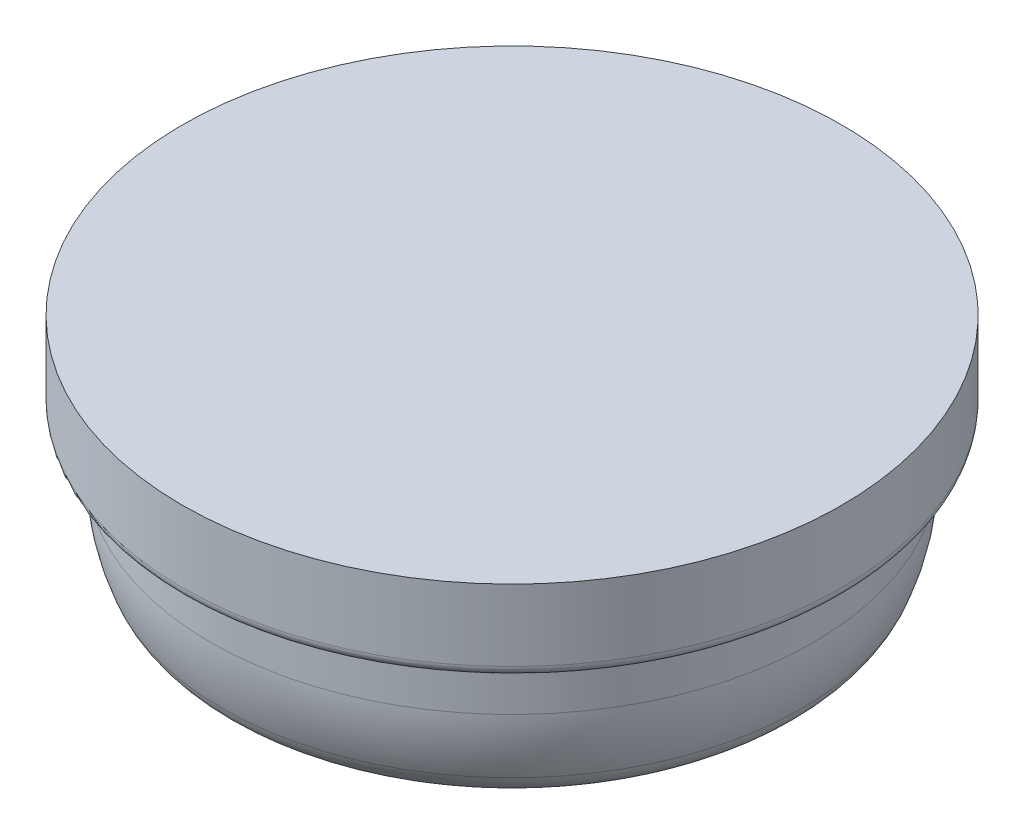
ISO-10303-21;
HEADER;
FILE_DESCRIPTION(('STEP AP214'),'2;1');
FILE_NAME('part.step','',(''),(''),'','','');
FILE_SCHEMA(('AUTOMOTIVE_DESIGN { 1 0 10303 214 1 1 1 1 }'));
ENDSEC;
DATA;
#1=APPLICATION_CONTEXT('core data for automotive mechanical design processes');
#2=APPLICATION_PROTOCOL_DEFINITION('international standard','automotive_design',2000,#1);
#3=PRODUCT_CONTEXT('',#1,'mechanical');
#4=PRODUCT('Part','Part','',(#3));
#5=PRODUCT_RELATED_PRODUCT_CATEGORY('part','',(#4));
#6=PRODUCT_DEFINITION_FORMATION('','',#4);
#7=PRODUCT_DEFINITION_CONTEXT('part definition',#1,'design');
#8=PRODUCT_DEFINITION('design','',#6,#7);
#9=PRODUCT_DEFINITION_SHAPE('','',#8);
#10=(LENGTH_UNIT() NAMED_UNIT(*) SI_UNIT(.MILLI.,.METRE.));
#11=(NAMED_UNIT(*) PLANE_ANGLE_UNIT() SI_UNIT($,.RADIAN.));
#12=(NAMED_UNIT(*) SI_UNIT($,.STERADIAN.) SOLID_ANGLE_UNIT());
#13=UNCERTAINTY_MEASURE_WITH_UNIT(LENGTH_MEASURE(1.E-05),#10,'distance_accuracy_value','');
#14=(GEOMETRIC_REPRESENTATION_CONTEXT(3) GLOBAL_UNCERTAINTY_ASSIGNED_CONTEXT((#13)) GLOBAL_UNIT_ASSIGNED_CONTEXT((#10,
#11,#12)) REPRESENTATION_CONTEXT('',''));
#15=CARTESIAN_POINT('',(0.,0.,0.));
#16=DIRECTION('',(0.,0.,1.));
#17=DIRECTION('',(1.,0.,0.));
#18=AXIS2_PLACEMENT_3D('',#15,#16,#17);
#19=CARTESIAN_POINT('',(0.,13.0472913738795,91.1860000000004));
#20=CARTESIAN_POINT('',(0.,13.0472913738794,93.9930756489206));
#21=CARTESIAN_POINT('',(0.,13.6614165071201,96.7096580848795));
#22=CARTESIAN_POINT('',(0.,14.832128030832,99.2127252525066));
#23=(BOUNDED_CURVE() B_SPLINE_CURVE(3,(#19,#20,#21,#22),.UNSPECIFIED.,.F.,
.F.) B_SPLINE_CURVE_WITH_KNOTS((4,4),(0.,1.),
.UNSPECIFIED.) CURVE() GEOMETRIC_REPRESENTATION_ITEM() RATIONAL_B_SPLINE_CURVE((0.254333095030252,
0.254333095030252,0.258499793724843,0.266833191114025)) REPRESENTATION_ITEM(''));
#24=CARTESIAN_POINT('',(0.,55.,0.));
#25=DIRECTION('',(0.,1.,0.));
#26=AXIS1_PLACEMENT('',#24,#25);
#27=SURFACE_OF_REVOLUTION('',#23,#26);
#28=CARTESIAN_POINT('',(0.,14.832128030832,0.));
#29=DIRECTION('',(0.,1.,0.));
#30=DIRECTION('',(0.,0.,1.));
#31=AXIS2_PLACEMENT_3D('',#28,#29,#30);
#32=CIRCLE('',#31,99.2127252525066);
#33=CARTESIAN_POINT('',(0.,14.832128030832,99.2127252525066));
#34=VERTEX_POINT('',#33);
#35=EDGE_CURVE('E66',#34,#34,#32,.T.);
#36=ORIENTED_EDGE('',*,*,#35,.F.);
#37=EDGE_LOOP('',(#36));
#38=FACE_BOUND('',#37,.T.);
#39=CARTESIAN_POINT('',(0.,13.0472913738796,0.));
#40=DIRECTION('',(0.,1.,0.));
#41=DIRECTION('',(0.,0.,1.));
#42=AXIS2_PLACEMENT_3D('',#39,#40,#41);
#43=CIRCLE('',#42,91.1860000000005);
#44=CARTESIAN_POINT('',(0.,13.0472913738796,91.1860000000005));
#45=VERTEX_POINT('',#44);
#46=EDGE_CURVE('E10',#45,#45,#43,.T.);
#47=ORIENTED_EDGE('',*,*,#46,.T.);
#48=EDGE_LOOP('',(#47));
#49=FACE_BOUND('',#48,.T.);
#50=ADVANCED_FACE('F34',(#38,#49),#27,.T.);
#51=CARTESIAN_POINT('',(0.,13.0472913738795,0.));
#52=DIRECTION('',(0.,-1.,0.));
#53=DIRECTION('',(0.,0.,-1.));
#54=AXIS2_PLACEMENT_3D('',#51,#52,#53);
#55=PLANE('',#54);
#56=ORIENTED_EDGE('',*,*,#46,.F.);
#57=EDGE_LOOP('',(#56));
#58=FACE_BOUND('',#57,.T.);
#59=ADVANCED_FACE('F79',(#58),#55,.T.);
#60=CARTESIAN_POINT('',(0.,113.365316058993,0.));
#61=DIRECTION('',(0.,-1.,0.));
#62=DIRECTION('',(0.,0.,-1.));
#63=AXIS2_PLACEMENT_3D('',#60,#61,#62);
#64=PLANE('',#63);
#65=CARTESIAN_POINT('',(0.,113.365316058993,0.));
#66=DIRECTION('',(0.,1.,0.));
#67=DIRECTION('',(0.,0.,1.));
#68=AXIS2_PLACEMENT_3D('',#65,#66,#67);
#69=CIRCLE('',#68,138.555289406168);
#70=CARTESIAN_POINT('',(0.,113.365316058993,138.555289406168));
#71=VERTEX_POINT('',#70);
#72=EDGE_CURVE('E41',#71,#71,#69,.T.);
#73=ORIENTED_EDGE('',*,*,#72,.T.);
#74=EDGE_LOOP('',(#73));
#75=FACE_BOUND('',#74,.T.);
#76=ADVANCED_FACE('F83',(#75),#64,.F.);
#77=CARTESIAN_POINT('',(0.,55.,0.));
#78=DIRECTION('',(0.,1.,0.));
#79=DIRECTION('',(0.,0.,1.));
#80=AXIS2_PLACEMENT_3D('',#77,#78,#79);
#81=CYLINDRICAL_SURFACE('',#80,138.555289406168);
#82=ORIENTED_EDGE('',*,*,#72,.F.);
#83=EDGE_LOOP('',(#82));
#84=FACE_BOUND('',#83,.T.);
#85=CARTESIAN_POINT('',(0.,83.3653160589928,0.));
#86=DIRECTION('',(0.,1.,0.));
#87=DIRECTION('',(0.,0.,1.));
#88=AXIS2_PLACEMENT_3D('',#85,#86,#87);
#89=CIRCLE('',#88,138.555289406168);
#90=CARTESIAN_POINT('',(0.,83.3653160589928,138.555289406168));
#91=VERTEX_POINT('',#90);
#92=EDGE_CURVE('E45',#91,#91,#89,.T.);
#93=ORIENTED_EDGE('',*,*,#92,.T.);
#94=EDGE_LOOP('',(#93));
#95=FACE_BOUND('',#94,.T.);
#96=ADVANCED_FACE('F88',(#84,#95),#81,.T.);
#97=CARTESIAN_POINT('',(0.,83.2420105318187,0.));
#98=DIRECTION('',(0.,1.,0.));
#99=DIRECTION('',(0.,0.,1.));
#100=AXIS2_PLACEMENT_3D('',#97,#98,#99);
#101=TOROIDAL_SURFACE('',#100,134.112,4.44499999999991);
#102=CARTESIAN_POINT('',(0.,78.8192913738797,0.));
#103=DIRECTION('',(0.,1.,0.));
#104=DIRECTION('',(0.,0.,1.));
#105=AXIS2_PLACEMENT_3D('',#102,#103,#104);
#106=CIRCLE('',#105,133.667500000001);
#107=CARTESIAN_POINT('',(0.,78.8192913738797,133.667500000001));
#108=VERTEX_POINT('',#107);
#109=EDGE_CURVE('E49',#108,#108,#106,.T.);
#110=ORIENTED_EDGE('',*,*,#109,.T.);
#111=EDGE_LOOP('',(#110));
#112=FACE_BOUND('',#111,.T.);
#113=ORIENTED_EDGE('',*,*,#92,.F.);
#114=EDGE_LOOP('',(#113));
#115=FACE_BOUND('',#114,.T.);
#116=ADVANCED_FACE('F93',(#112,#115),#101,.T.);
#117=CARTESIAN_POINT('',(0.,72.5011211482528,0.));
#118=DIRECTION('',(0.,1.,0.));
#119=DIRECTION('',(0.,0.,1.));
#120=AXIS2_PLACEMENT_3D('',#117,#118,#119);
#121=TOROIDAL_SURFACE('',#120,133.0325,6.34999999999996);
#122=ORIENTED_EDGE('',*,*,#109,.F.);
#123=EDGE_LOOP('',(#122));
#124=FACE_BOUND('',#123,.T.);
#125=CARTESIAN_POINT('',(0.,72.5011211482528,0.));
#126=DIRECTION('',(0.,1.,0.));
#127=DIRECTION('',(0.,0.,1.));
#128=AXIS2_PLACEMENT_3D('',#125,#126,#127);
#129=CIRCLE('',#128,126.6825);
#130=CARTESIAN_POINT('',(0.,72.5011211482528,126.6825));
#131=VERTEX_POINT('',#130);
#132=EDGE_CURVE('E54',#131,#131,#129,.T.);
#133=ORIENTED_EDGE('',*,*,#132,.T.);
#134=EDGE_LOOP('',(#133));
#135=FACE_BOUND('',#134,.T.);
#136=ADVANCED_FACE('F97',(#124,#135),#121,.F.);
#137=CARTESIAN_POINT('',(0.,55.,0.));
#138=DIRECTION('',(0.,1.,0.));
#139=DIRECTION('',(0.,0.,1.));
#140=AXIS2_PLACEMENT_3D('',#137,#138,#139);
#141=CYLINDRICAL_SURFACE('',#140,126.6825);
#142=CARTESIAN_POINT('',(0.,57.5011211482528,0.));
#143=DIRECTION('',(0.,1.,0.));
#144=DIRECTION('',(0.,0.,1.));
#145=AXIS2_PLACEMENT_3D('',#142,#143,#144);
#146=CIRCLE('',#145,126.6825);
#147=CARTESIAN_POINT('',(0.,57.5011211482528,126.6825));
#148=VERTEX_POINT('',#147);
#149=EDGE_CURVE('E57',#148,#148,#146,.T.);
#150=ORIENTED_EDGE('',*,*,#149,.T.);
#151=EDGE_LOOP('',(#150));
#152=FACE_BOUND('',#151,.T.);
#153=ORIENTED_EDGE('',*,*,#132,.F.);
#154=EDGE_LOOP('',(#153));
#155=FACE_BOUND('',#154,.T.);
#156=ADVANCED_FACE('F101',(#152,#155),#141,.T.);
#157=CARTESIAN_POINT('',(0.,57.5011211482528,0.));
#158=DIRECTION('',(0.,1.,0.));
#159=DIRECTION('',(0.,0.,1.));
#160=AXIS2_PLACEMENT_3D('',#157,#158,#159);
#161=DEGENERATE_TOROIDAL_SURFACE('',#160,54.0473043126088,72.6351956873913,.T.);
#162=ORIENTED_EDGE('',*,*,#149,.F.);
#163=EDGE_LOOP('',(#162));
#164=FACE_BOUND('',#163,.T.);
#165=CARTESIAN_POINT('',(0.,30.8840402786734,0.));
#166=DIRECTION('',(0.,1.,0.));
#167=DIRECTION('',(0.,0.,1.));
#168=AXIS2_PLACEMENT_3D('',#165,#166,#167);
#169=CIRCLE('',#168,121.629866105781);
#170=CARTESIAN_POINT('',(0.,30.8840402786734,121.629866105781));
#171=VERTEX_POINT('',#170);
#172=EDGE_CURVE('E60',#171,#171,#169,.T.);
#173=ORIENTED_EDGE('',*,*,#172,.T.);
#174=EDGE_LOOP('',(#173));
#175=FACE_BOUND('',#174,.T.);
#176=ADVANCED_FACE('F105',(#164,#175),#161,.T.);
#177=CARTESIAN_POINT('',(0.,37.6315363697442,0.));
#178=DIRECTION('',(0.,1.,0.));
#179=DIRECTION('',(0.,0.,1.));
#180=AXIS2_PLACEMENT_3D('',#177,#178,#179);
#181=TOROIDAL_SURFACE('',#180,104.49751888264,18.4132024610953);
#182=CARTESIAN_POINT('',(0.,20.9524825050762,0.));
#183=DIRECTION('',(0.,1.,0.));
#184=DIRECTION('',(0.,0.,1.));
#185=AXIS2_PLACEMENT_3D('',#182,#183,#184);
#186=CIRCLE('',#185,112.298492350919);
#187=CARTESIAN_POINT('',(0.,20.9524825050762,112.298492350919));
#188=VERTEX_POINT('',#187);
#189=EDGE_CURVE('E63',#188,#188,#186,.T.);
#190=ORIENTED_EDGE('',*,*,#189,.T.);
#191=EDGE_LOOP('',(#190));
#192=FACE_BOUND('',#191,.T.);
#193=ORIENTED_EDGE('',*,*,#172,.F.);
#194=EDGE_LOOP('',(#193));
#195=FACE_BOUND('',#194,.T.);
#196=ADVANCED_FACE('F109',(#192,#195),#181,.T.);
#197=CARTESIAN_POINT('',(0.,14.832128030832,0.));
#198=DIRECTION('',(0.,1.,0.));
#199=DIRECTION('',(0.,0.,1.));
#200=AXIS2_PLACEMENT_3D('',#197,#198,#199);
#201=CONICAL_SURFACE('',#200,99.2127252525066,1.13331210913786);
#202=ORIENTED_EDGE('',*,*,#189,.F.);
#203=EDGE_LOOP('',(#202));
#204=FACE_BOUND('',#203,.T.);
#205=ORIENTED_EDGE('',*,*,#35,.T.);
#206=EDGE_LOOP('',(#205));
#207=FACE_BOUND('',#206,.T.);
#208=ADVANCED_FACE('F76',(#204,#207),#201,.T.);
#209=CLOSED_SHELL('',(#50,#59,#76,#96,#116,#136,#156,#176,#196,#208));
#210=MANIFOLD_SOLID_BREP('B2',#209);
#211=ADVANCED_BREP_SHAPE_REPRESENTATION('',(#18,#210),#14);
#212=SHAPE_DEFINITION_REPRESENTATION(#9,#211);
ENDSEC;
END-ISO-10303-21;
